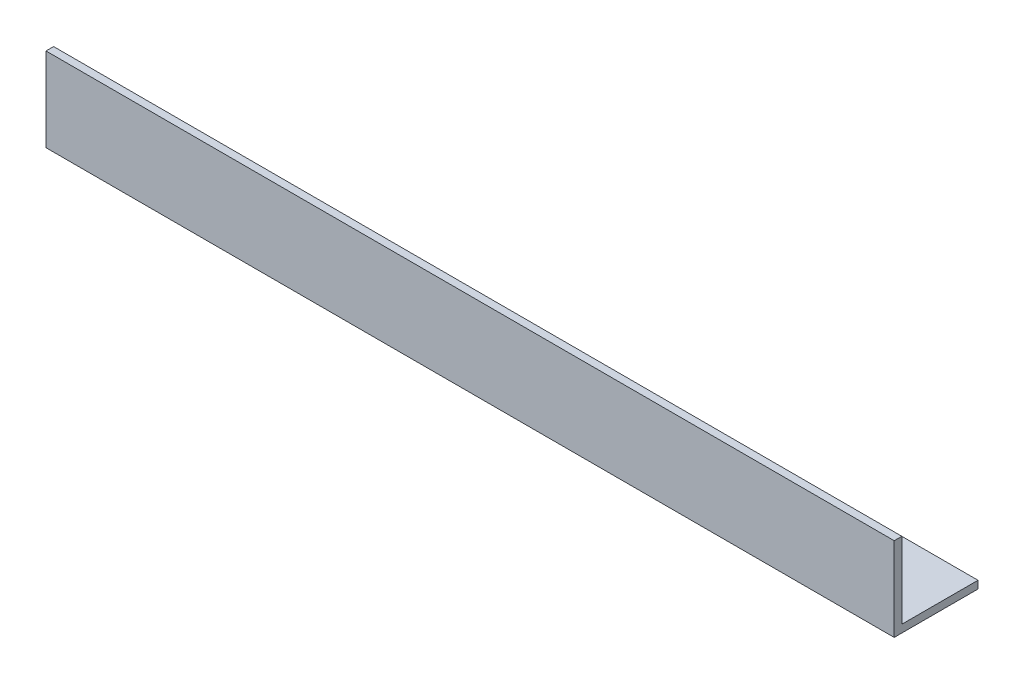
ISO-10303-21;
HEADER;
FILE_DESCRIPTION(('STEP AP214'),'2;1');
FILE_NAME('part.step','',(''),(''),'','','');
FILE_SCHEMA(('AUTOMOTIVE_DESIGN { 1 0 10303 214 1 1 1 1 }'));
ENDSEC;
DATA;
#1=APPLICATION_CONTEXT('core data for automotive mechanical design processes');
#2=APPLICATION_PROTOCOL_DEFINITION('international standard','automotive_design',2000,#1);
#3=PRODUCT_CONTEXT('',#1,'mechanical');
#4=PRODUCT('Part','Part','',(#3));
#5=PRODUCT_RELATED_PRODUCT_CATEGORY('part','',(#4));
#6=PRODUCT_DEFINITION_FORMATION('','',#4);
#7=PRODUCT_DEFINITION_CONTEXT('part definition',#1,'design');
#8=PRODUCT_DEFINITION('design','',#6,#7);
#9=PRODUCT_DEFINITION_SHAPE('','',#8);
#10=(LENGTH_UNIT() NAMED_UNIT(*) SI_UNIT(.MILLI.,.METRE.));
#11=(NAMED_UNIT(*) PLANE_ANGLE_UNIT() SI_UNIT($,.RADIAN.));
#12=(NAMED_UNIT(*) SI_UNIT($,.STERADIAN.) SOLID_ANGLE_UNIT());
#13=UNCERTAINTY_MEASURE_WITH_UNIT(LENGTH_MEASURE(1.E-05),#10,'distance_accuracy_value','');
#14=(GEOMETRIC_REPRESENTATION_CONTEXT(3) GLOBAL_UNCERTAINTY_ASSIGNED_CONTEXT((#13)) GLOBAL_UNIT_ASSIGNED_CONTEXT((#10,
#11,#12)) REPRESENTATION_CONTEXT('',''));
#15=CARTESIAN_POINT('',(0.,0.,0.));
#16=DIRECTION('',(0.,0.,1.));
#17=DIRECTION('',(1.,0.,0.));
#18=AXIS2_PLACEMENT_3D('',#15,#16,#17);
#19=CARTESIAN_POINT('',(334.,0.,0.));
#20=DIRECTION('',(0.,1.,0.));
#21=DIRECTION('',(0.,0.,1.));
#22=AXIS2_PLACEMENT_3D('',#19,#20,#21);
#23=PLANE('',#22);
#24=DIRECTION('',(0.,0.,-1.));
#25=VECTOR('',#24,1.);
#26=CARTESIAN_POINT('',(0.,0.,0.));
#27=LINE('',#26,#25);
#28=CARTESIAN_POINT('',(0.,0.,0.));
#29=VERTEX_POINT('',#28);
#30=CARTESIAN_POINT('',(0.,0.,-33.));
#31=VERTEX_POINT('',#30);
#32=EDGE_CURVE('E113',#29,#31,#27,.T.);
#33=ORIENTED_EDGE('',*,*,#32,.T.);
#34=DIRECTION('',(-1.,0.,0.));
#35=VECTOR('',#34,1.);
#36=CARTESIAN_POINT('',(334.,0.,-33.));
#37=LINE('',#36,#35);
#38=CARTESIAN_POINT('',(334.,0.,-33.));
#39=VERTEX_POINT('',#38);
#40=EDGE_CURVE('E11',#39,#31,#37,.T.);
#41=ORIENTED_EDGE('',*,*,#40,.F.);
#42=DIRECTION('',(0.,0.,-1.));
#43=VECTOR('',#42,1.);
#44=CARTESIAN_POINT('',(334.,0.,0.));
#45=LINE('',#44,#43);
#46=CARTESIAN_POINT('',(334.,0.,0.));
#47=VERTEX_POINT('',#46);
#48=EDGE_CURVE('E78',#47,#39,#45,.T.);
#49=ORIENTED_EDGE('',*,*,#48,.F.);
#50=DIRECTION('',(-1.,0.,0.));
#51=VECTOR('',#50,1.);
#52=CARTESIAN_POINT('',(334.,0.,0.));
#53=LINE('',#52,#51);
#54=EDGE_CURVE('E109',#47,#29,#53,.T.);
#55=ORIENTED_EDGE('',*,*,#54,.T.);
#56=EDGE_LOOP('',(#33,#41,#49,#55));
#57=FACE_BOUND('',#56,.T.);
#58=ADVANCED_FACE('F32',(#57),#23,.F.);
#59=CARTESIAN_POINT('',(334.,3.,-33.));
#60=DIRECTION('',(0.,0.,-1.));
#61=DIRECTION('',(-1.,0.,0.));
#62=AXIS2_PLACEMENT_3D('',#59,#60,#61);
#63=PLANE('',#62);
#64=DIRECTION('',(0.,-1.,0.));
#65=VECTOR('',#64,1.);
#66=CARTESIAN_POINT('',(0.,3.,-33.));
#67=LINE('',#66,#65);
#68=CARTESIAN_POINT('',(0.,3.,-33.));
#69=VERTEX_POINT('',#68);
#70=EDGE_CURVE('E116',#69,#31,#67,.T.);
#71=ORIENTED_EDGE('',*,*,#70,.F.);
#72=DIRECTION('',(-1.,0.,0.));
#73=VECTOR('',#72,1.);
#74=CARTESIAN_POINT('',(334.,3.,-33.));
#75=LINE('',#74,#73);
#76=CARTESIAN_POINT('',(334.,3.,-33.));
#77=VERTEX_POINT('',#76);
#78=EDGE_CURVE('E40',#77,#69,#75,.T.);
#79=ORIENTED_EDGE('',*,*,#78,.F.);
#80=DIRECTION('',(0.,-1.,0.));
#81=VECTOR('',#80,1.);
#82=CARTESIAN_POINT('',(334.,3.,-33.));
#83=LINE('',#82,#81);
#84=EDGE_CURVE('E202',#77,#39,#83,.T.);
#85=ORIENTED_EDGE('',*,*,#84,.T.);
#86=ORIENTED_EDGE('',*,*,#40,.T.);
#87=EDGE_LOOP('',(#71,#79,#85,#86));
#88=FACE_BOUND('',#87,.T.);
#89=ADVANCED_FACE('F134',(#88),#63,.T.);
#90=CARTESIAN_POINT('',(334.,3.,0.));
#91=DIRECTION('',(0.,1.,0.));
#92=DIRECTION('',(0.,0.,1.));
#93=AXIS2_PLACEMENT_3D('',#90,#91,#92);
#94=PLANE('',#93);
#95=DIRECTION('',(0.,0.,-1.));
#96=VECTOR('',#95,1.);
#97=CARTESIAN_POINT('',(0.,3.,0.));
#98=LINE('',#97,#96);
#99=CARTESIAN_POINT('',(0.,3.,-3.));
#100=VERTEX_POINT('',#99);
#101=EDGE_CURVE('E119',#100,#69,#98,.T.);
#102=ORIENTED_EDGE('',*,*,#101,.F.);
#103=DIRECTION('',(-1.,0.,0.));
#104=VECTOR('',#103,1.);
#105=CARTESIAN_POINT('',(334.,3.,-3.));
#106=LINE('',#105,#104);
#107=CARTESIAN_POINT('',(334.,3.,-3.));
#108=VERTEX_POINT('',#107);
#109=EDGE_CURVE('E99',#108,#100,#106,.T.);
#110=ORIENTED_EDGE('',*,*,#109,.F.);
#111=DIRECTION('',(0.,0.,-1.));
#112=VECTOR('',#111,1.);
#113=CARTESIAN_POINT('',(334.,3.,0.));
#114=LINE('',#113,#112);
#115=EDGE_CURVE('E105',#108,#77,#114,.T.);
#116=ORIENTED_EDGE('',*,*,#115,.T.);
#117=ORIENTED_EDGE('',*,*,#78,.T.);
#118=EDGE_LOOP('',(#102,#110,#116,#117));
#119=FACE_BOUND('',#118,.T.);
#120=ADVANCED_FACE('F131',(#119),#94,.T.);
#121=CARTESIAN_POINT('',(334.,33.,-3.));
#122=DIRECTION('',(0.,0.,-1.));
#123=DIRECTION('',(0.,1.,0.));
#124=AXIS2_PLACEMENT_3D('',#121,#122,#123);
#125=PLANE('',#124);
#126=DIRECTION('',(0.,-1.,0.));
#127=VECTOR('',#126,1.);
#128=CARTESIAN_POINT('',(0.,33.,-3.));
#129=LINE('',#128,#127);
#130=CARTESIAN_POINT('',(0.,33.,-3.));
#131=VERTEX_POINT('',#130);
#132=EDGE_CURVE('E94',#131,#100,#129,.T.);
#133=ORIENTED_EDGE('',*,*,#132,.F.);
#134=DIRECTION('',(-1.,0.,0.));
#135=VECTOR('',#134,1.);
#136=CARTESIAN_POINT('',(334.,33.,-3.));
#137=LINE('',#136,#135);
#138=CARTESIAN_POINT('',(334.,33.,-3.));
#139=VERTEX_POINT('',#138);
#140=EDGE_CURVE('E89',#139,#131,#137,.T.);
#141=ORIENTED_EDGE('',*,*,#140,.F.);
#142=DIRECTION('',(0.,-1.,0.));
#143=VECTOR('',#142,1.);
#144=CARTESIAN_POINT('',(334.,33.,-3.));
#145=LINE('',#144,#143);
#146=EDGE_CURVE('E92',#139,#108,#145,.T.);
#147=ORIENTED_EDGE('',*,*,#146,.T.);
#148=ORIENTED_EDGE('',*,*,#109,.T.);
#149=EDGE_LOOP('',(#133,#141,#147,#148));
#150=FACE_BOUND('',#149,.T.);
#151=ADVANCED_FACE('F91',(#150),#125,.T.);
#152=CARTESIAN_POINT('',(334.,33.,0.));
#153=DIRECTION('',(0.,1.,0.));
#154=DIRECTION('',(0.,0.,1.));
#155=AXIS2_PLACEMENT_3D('',#152,#153,#154);
#156=PLANE('',#155);
#157=DIRECTION('',(0.,0.,-1.));
#158=VECTOR('',#157,1.);
#159=CARTESIAN_POINT('',(0.,33.,0.));
#160=LINE('',#159,#158);
#161=CARTESIAN_POINT('',(0.,33.,0.));
#162=VERTEX_POINT('',#161);
#163=EDGE_CURVE('E123',#162,#131,#160,.T.);
#164=ORIENTED_EDGE('',*,*,#163,.F.);
#165=DIRECTION('',(-1.,0.,0.));
#166=VECTOR('',#165,1.);
#167=CARTESIAN_POINT('',(334.,33.,0.));
#168=LINE('',#167,#166);
#169=CARTESIAN_POINT('',(334.,33.,0.));
#170=VERTEX_POINT('',#169);
#171=EDGE_CURVE('E69',#170,#162,#168,.T.);
#172=ORIENTED_EDGE('',*,*,#171,.F.);
#173=DIRECTION('',(0.,0.,-1.));
#174=VECTOR('',#173,1.);
#175=CARTESIAN_POINT('',(334.,33.,0.));
#176=LINE('',#175,#174);
#177=EDGE_CURVE('E103',#170,#139,#176,.T.);
#178=ORIENTED_EDGE('',*,*,#177,.T.);
#179=ORIENTED_EDGE('',*,*,#140,.T.);
#180=EDGE_LOOP('',(#164,#172,#178,#179));
#181=FACE_BOUND('',#180,.T.);
#182=ADVANCED_FACE('F107',(#181),#156,.T.);
#183=CARTESIAN_POINT('',(334.,33.,0.));
#184=DIRECTION('',(0.,0.,-1.));
#185=DIRECTION('',(0.,1.,0.));
#186=AXIS2_PLACEMENT_3D('',#183,#184,#185);
#187=PLANE('',#186);
#188=DIRECTION('',(0.,-1.,0.));
#189=VECTOR('',#188,1.);
#190=CARTESIAN_POINT('',(0.,33.,0.));
#191=LINE('',#190,#189);
#192=EDGE_CURVE('E72',#162,#29,#191,.T.);
#193=ORIENTED_EDGE('',*,*,#192,.T.);
#194=ORIENTED_EDGE('',*,*,#54,.F.);
#195=DIRECTION('',(0.,-1.,0.));
#196=VECTOR('',#195,1.);
#197=CARTESIAN_POINT('',(334.,33.,0.));
#198=LINE('',#197,#196);
#199=EDGE_CURVE('E48',#170,#47,#198,.T.);
#200=ORIENTED_EDGE('',*,*,#199,.F.);
#201=ORIENTED_EDGE('',*,*,#171,.T.);
#202=EDGE_LOOP('',(#193,#194,#200,#201));
#203=FACE_BOUND('',#202,.T.);
#204=ADVANCED_FACE('F139',(#203),#187,.F.);
#205=CARTESIAN_POINT('',(334.,0.,0.));
#206=DIRECTION('',(-1.,0.,0.));
#207=DIRECTION('',(0.,0.,1.));
#208=AXIS2_PLACEMENT_3D('',#205,#206,#207);
#209=PLANE('',#208);
#210=ORIENTED_EDGE('',*,*,#48,.T.);
#211=ORIENTED_EDGE('',*,*,#84,.F.);
#212=ORIENTED_EDGE('',*,*,#115,.F.);
#213=ORIENTED_EDGE('',*,*,#146,.F.);
#214=ORIENTED_EDGE('',*,*,#177,.F.);
#215=ORIENTED_EDGE('',*,*,#199,.T.);
#216=EDGE_LOOP('',(#210,#211,#212,#213,#214,#215));
#217=FACE_BOUND('',#216,.T.);
#218=ADVANCED_FACE('F102',(#217),#209,.F.);
#219=CARTESIAN_POINT('',(0.,0.,0.));
#220=DIRECTION('',(-1.,0.,0.));
#221=DIRECTION('',(0.,0.,1.));
#222=AXIS2_PLACEMENT_3D('',#219,#220,#221);
#223=PLANE('',#222);
#224=ORIENTED_EDGE('',*,*,#32,.F.);
#225=ORIENTED_EDGE('',*,*,#192,.F.);
#226=ORIENTED_EDGE('',*,*,#163,.T.);
#227=ORIENTED_EDGE('',*,*,#132,.T.);
#228=ORIENTED_EDGE('',*,*,#101,.T.);
#229=ORIENTED_EDGE('',*,*,#70,.T.);
#230=EDGE_LOOP('',(#224,#225,#226,#227,#228,#229));
#231=FACE_BOUND('',#230,.T.);
#232=ADVANCED_FACE('F137',(#231),#223,.T.);
#233=CLOSED_SHELL('',(#58,#89,#120,#151,#182,#204,#218,#232));
#234=MANIFOLD_SOLID_BREP('B2',#233);
#235=ADVANCED_BREP_SHAPE_REPRESENTATION('',(#18,#234),#14);
#236=SHAPE_DEFINITION_REPRESENTATION(#9,#235);
ENDSEC;
END-ISO-10303-21;
